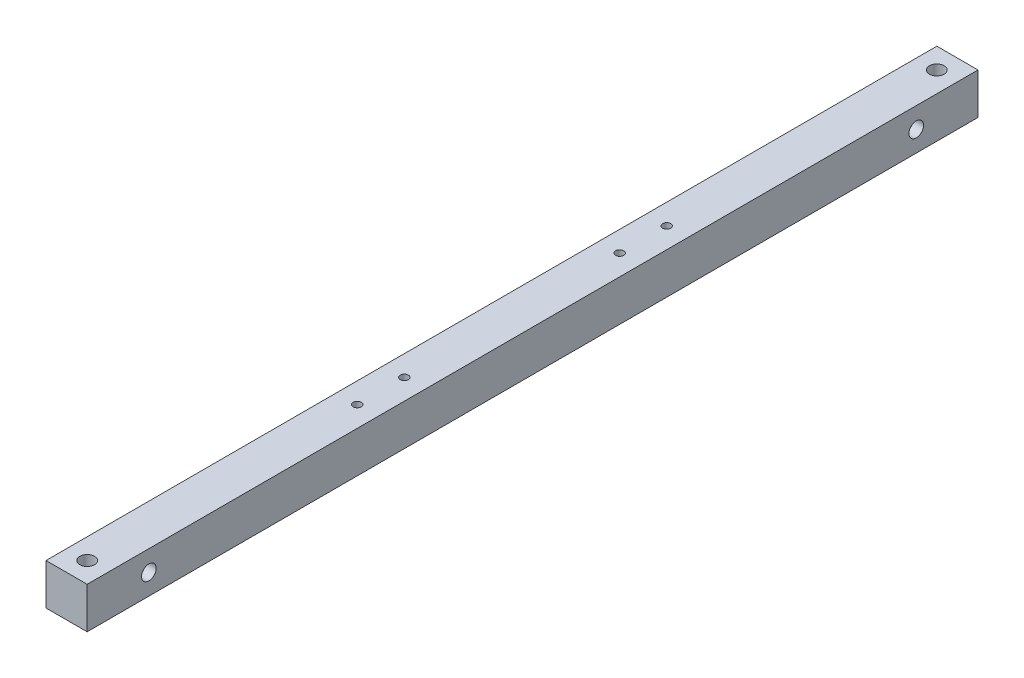
ISO-10303-21;
HEADER;
FILE_DESCRIPTION(('STEP AP214'),'2;1');
FILE_NAME('part.step','',(''),(''),'','','');
FILE_SCHEMA(('AUTOMOTIVE_DESIGN { 1 0 10303 214 1 1 1 1 }'));
ENDSEC;
DATA;
#1=APPLICATION_CONTEXT('core data for automotive mechanical design processes');
#2=APPLICATION_PROTOCOL_DEFINITION('international standard','automotive_design',2000,#1);
#3=PRODUCT_CONTEXT('',#1,'mechanical');
#4=PRODUCT('Part','Part','',(#3));
#5=PRODUCT_RELATED_PRODUCT_CATEGORY('part','',(#4));
#6=PRODUCT_DEFINITION_FORMATION('','',#4);
#7=PRODUCT_DEFINITION_CONTEXT('part definition',#1,'design');
#8=PRODUCT_DEFINITION('design','',#6,#7);
#9=PRODUCT_DEFINITION_SHAPE('','',#8);
#10=(LENGTH_UNIT() NAMED_UNIT(*) SI_UNIT(.MILLI.,.METRE.));
#11=(NAMED_UNIT(*) PLANE_ANGLE_UNIT() SI_UNIT($,.RADIAN.));
#12=(NAMED_UNIT(*) SI_UNIT($,.STERADIAN.) SOLID_ANGLE_UNIT());
#13=UNCERTAINTY_MEASURE_WITH_UNIT(LENGTH_MEASURE(1.E-05),#10,'distance_accuracy_value','');
#14=(GEOMETRIC_REPRESENTATION_CONTEXT(3) GLOBAL_UNCERTAINTY_ASSIGNED_CONTEXT((#13)) GLOBAL_UNIT_ASSIGNED_CONTEXT((#10,
#11,#12)) REPRESENTATION_CONTEXT('',''));
#15=CARTESIAN_POINT('',(0.,0.,0.));
#16=DIRECTION('',(0.,0.,1.));
#17=DIRECTION('',(1.,0.,0.));
#18=AXIS2_PLACEMENT_3D('',#15,#16,#17);
#19=CARTESIAN_POINT('',(0.,14.001,592.));
#20=DIRECTION('',(0.,-1.,0.));
#21=DIRECTION('',(0.,0.,-1.));
#22=AXIS2_PLACEMENT_3D('',#19,#20,#21);
#23=CYLINDRICAL_SURFACE('',#22,3.);
#24=CARTESIAN_POINT('',(0.,-14.,592.));
#25=DIRECTION('',(0.,-1.,0.));
#26=DIRECTION('',(0.,0.,-1.));
#27=AXIS2_PLACEMENT_3D('',#24,#25,#26);
#28=CIRCLE('',#27,3.);
#29=CARTESIAN_POINT('',(0.,-14.,589.));
#30=VERTEX_POINT('',#29);
#31=EDGE_CURVE('E122',#30,#30,#28,.T.);
#32=ORIENTED_EDGE('',*,*,#31,.T.);
#33=EDGE_LOOP('',(#32));
#34=FACE_BOUND('',#33,.T.);
#35=CARTESIAN_POINT('',(0.,7.,592.));
#36=DIRECTION('',(0.,1.,0.));
#37=DIRECTION('',(0.,0.,1.));
#38=AXIS2_PLACEMENT_3D('',#35,#36,#37);
#39=CIRCLE('',#38,3.);
#40=CARTESIAN_POINT('',(0.,7.,595.));
#41=VERTEX_POINT('',#40);
#42=EDGE_CURVE('E37',#41,#41,#39,.F.);
#43=ORIENTED_EDGE('',*,*,#42,.F.);
#44=EDGE_LOOP('',(#43));
#45=FACE_BOUND('',#44,.T.);
#46=ADVANCED_FACE('F33',(#34,#45),#23,.F.);
#47=CARTESIAN_POINT('',(0.,14.001,14.));
#48=DIRECTION('',(0.,-1.,0.));
#49=DIRECTION('',(0.,0.,-1.));
#50=AXIS2_PLACEMENT_3D('',#47,#48,#49);
#51=CYLINDRICAL_SURFACE('',#50,3.);
#52=CARTESIAN_POINT('',(0.,-14.,14.));
#53=DIRECTION('',(0.,-1.,0.));
#54=DIRECTION('',(0.,0.,-1.));
#55=AXIS2_PLACEMENT_3D('',#52,#53,#54);
#56=CIRCLE('',#55,3.);
#57=CARTESIAN_POINT('',(0.,-14.,11.));
#58=VERTEX_POINT('',#57);
#59=EDGE_CURVE('E141',#58,#58,#56,.T.);
#60=ORIENTED_EDGE('',*,*,#59,.T.);
#61=EDGE_LOOP('',(#60));
#62=FACE_BOUND('',#61,.T.);
#63=CARTESIAN_POINT('',(0.,7.,14.));
#64=DIRECTION('',(0.,1.,0.));
#65=DIRECTION('',(0.,0.,1.));
#66=AXIS2_PLACEMENT_3D('',#63,#64,#65);
#67=CIRCLE('',#66,3.);
#68=CARTESIAN_POINT('',(0.,7.,17.));
#69=VERTEX_POINT('',#68);
#70=EDGE_CURVE('E116',#69,#69,#67,.F.);
#71=ORIENTED_EDGE('',*,*,#70,.F.);
#72=EDGE_LOOP('',(#71));
#73=FACE_BOUND('',#72,.T.);
#74=ADVANCED_FACE('F166',(#62,#73),#51,.F.);
#75=CARTESIAN_POINT('',(14.,-14.,606.));
#76=DIRECTION('',(-1.,0.,0.));
#77=DIRECTION('',(0.,0.,1.));
#78=AXIS2_PLACEMENT_3D('',#75,#76,#77);
#79=PLANE('',#78);
#80=CARTESIAN_POINT('',(14.,0.,564.));
#81=DIRECTION('',(1.,0.,0.));
#82=DIRECTION('',(0.,0.,-1.));
#83=AXIS2_PLACEMENT_3D('',#80,#81,#82);
#84=CIRCLE('',#83,5.00000000000004);
#85=CARTESIAN_POINT('',(14.,0.,559.));
#86=VERTEX_POINT('',#85);
#87=EDGE_CURVE('E153',#86,#86,#84,.T.);
#88=ORIENTED_EDGE('',*,*,#87,.F.);
#89=EDGE_LOOP('',(#88));
#90=FACE_BOUND('',#89,.T.);
#91=CARTESIAN_POINT('',(14.,0.,42.));
#92=DIRECTION('',(1.,0.,0.));
#93=DIRECTION('',(0.,0.,-1.));
#94=AXIS2_PLACEMENT_3D('',#91,#92,#93);
#95=CIRCLE('',#94,5.);
#96=CARTESIAN_POINT('',(14.,0.,37.));
#97=VERTEX_POINT('',#96);
#98=EDGE_CURVE('E115',#97,#97,#95,.T.);
#99=ORIENTED_EDGE('',*,*,#98,.F.);
#100=EDGE_LOOP('',(#99));
#101=FACE_BOUND('',#100,.T.);
#102=DIRECTION('',(0.,1.,0.));
#103=VECTOR('',#102,1.);
#104=CARTESIAN_POINT('',(14.,-14.,0.));
#105=LINE('',#104,#103);
#106=CARTESIAN_POINT('',(14.,-14.,0.));
#107=VERTEX_POINT('',#106);
#108=CARTESIAN_POINT('',(14.,14.,0.));
#109=VERTEX_POINT('',#108);
#110=EDGE_CURVE('E100',#107,#109,#105,.T.);
#111=ORIENTED_EDGE('',*,*,#110,.T.);
#112=DIRECTION('',(0.,0.,-1.));
#113=VECTOR('',#112,1.);
#114=CARTESIAN_POINT('',(14.,14.,606.));
#115=LINE('',#114,#113);
#116=CARTESIAN_POINT('',(14.,14.,606.));
#117=VERTEX_POINT('',#116);
#118=EDGE_CURVE('E11',#117,#109,#115,.T.);
#119=ORIENTED_EDGE('',*,*,#118,.F.);
#120=DIRECTION('',(0.,1.,0.));
#121=VECTOR('',#120,1.);
#122=CARTESIAN_POINT('',(14.,-14.,606.));
#123=LINE('',#122,#121);
#124=CARTESIAN_POINT('',(14.,-14.,606.));
#125=VERTEX_POINT('',#124);
#126=EDGE_CURVE('E87',#125,#117,#123,.T.);
#127=ORIENTED_EDGE('',*,*,#126,.F.);
#128=DIRECTION('',(0.,0.,-1.));
#129=VECTOR('',#128,1.);
#130=CARTESIAN_POINT('',(14.,-14.,606.));
#131=LINE('',#130,#129);
#132=EDGE_CURVE('E96',#125,#107,#131,.T.);
#133=ORIENTED_EDGE('',*,*,#132,.T.);
#134=EDGE_LOOP('',(#111,#119,#127,#133));
#135=FACE_BOUND('',#134,.T.);
#136=ADVANCED_FACE('F35',(#90,#101,#135),#79,.F.);
#137=CARTESIAN_POINT('',(-14.,14.,606.));
#138=DIRECTION('',(0.,-1.,0.));
#139=DIRECTION('',(0.,0.,-1.));
#140=AXIS2_PLACEMENT_3D('',#137,#138,#139);
#141=PLANE('',#140);
#142=CARTESIAN_POINT('',(0.,14.,408.25));
#143=DIRECTION('',(0.,1.,0.));
#144=DIRECTION('',(0.,0.,1.));
#145=AXIS2_PLACEMENT_3D('',#142,#143,#144);
#146=CIRCLE('',#145,2.75);
#147=CARTESIAN_POINT('',(0.,14.,411.));
#148=VERTEX_POINT('',#147);
#149=EDGE_CURVE('E239',#148,#148,#146,.T.);
#150=ORIENTED_EDGE('',*,*,#149,.F.);
#151=EDGE_LOOP('',(#150));
#152=FACE_BOUND('',#151,.T.);
#153=CARTESIAN_POINT('',(0.,14.,376.25));
#154=DIRECTION('',(0.,1.,0.));
#155=DIRECTION('',(0.,0.,1.));
#156=AXIS2_PLACEMENT_3D('',#153,#154,#155);
#157=CIRCLE('',#156,2.75);
#158=CARTESIAN_POINT('',(0.,14.,379.));
#159=VERTEX_POINT('',#158);
#160=EDGE_CURVE('E243',#159,#159,#157,.T.);
#161=ORIENTED_EDGE('',*,*,#160,.F.);
#162=EDGE_LOOP('',(#161));
#163=FACE_BOUND('',#162,.T.);
#164=CARTESIAN_POINT('',(0.,14.,229.75));
#165=DIRECTION('',(0.,1.,0.));
#166=DIRECTION('',(0.,0.,-1.));
#167=AXIS2_PLACEMENT_3D('',#164,#165,#166);
#168=CIRCLE('',#167,2.75);
#169=CARTESIAN_POINT('',(0.,14.,227.));
#170=VERTEX_POINT('',#169);
#171=EDGE_CURVE('E247',#170,#170,#168,.T.);
#172=ORIENTED_EDGE('',*,*,#171,.F.);
#173=EDGE_LOOP('',(#172));
#174=FACE_BOUND('',#173,.T.);
#175=CARTESIAN_POINT('',(0.,14.,197.75));
#176=DIRECTION('',(0.,1.,0.));
#177=DIRECTION('',(0.,0.,-1.));
#178=AXIS2_PLACEMENT_3D('',#175,#176,#177);
#179=CIRCLE('',#178,2.75);
#180=CARTESIAN_POINT('',(0.,14.,195.));
#181=VERTEX_POINT('',#180);
#182=EDGE_CURVE('E132',#181,#181,#179,.T.);
#183=ORIENTED_EDGE('',*,*,#182,.F.);
#184=EDGE_LOOP('',(#183));
#185=FACE_BOUND('',#184,.T.);
#186=CARTESIAN_POINT('',(0.,14.,592.));
#187=DIRECTION('',(0.,1.,0.));
#188=DIRECTION('',(0.,0.,1.));
#189=AXIS2_PLACEMENT_3D('',#186,#187,#188);
#190=CIRCLE('',#189,5.);
#191=CARTESIAN_POINT('',(0.,14.,597.));
#192=VERTEX_POINT('',#191);
#193=EDGE_CURVE('E124',#192,#192,#190,.T.);
#194=ORIENTED_EDGE('',*,*,#193,.F.);
#195=EDGE_LOOP('',(#194));
#196=FACE_BOUND('',#195,.T.);
#197=CARTESIAN_POINT('',(0.,14.,14.));
#198=DIRECTION('',(0.,1.,0.));
#199=DIRECTION('',(0.,0.,1.));
#200=AXIS2_PLACEMENT_3D('',#197,#198,#199);
#201=CIRCLE('',#200,5.);
#202=CARTESIAN_POINT('',(0.,14.,19.));
#203=VERTEX_POINT('',#202);
#204=EDGE_CURVE('E137',#203,#203,#201,.T.);
#205=ORIENTED_EDGE('',*,*,#204,.F.);
#206=EDGE_LOOP('',(#205));
#207=FACE_BOUND('',#206,.T.);
#208=DIRECTION('',(-1.,0.,0.));
#209=VECTOR('',#208,1.);
#210=CARTESIAN_POINT('',(-14.,14.,0.));
#211=LINE('',#210,#209);
#212=CARTESIAN_POINT('',(-14.,14.,0.));
#213=VERTEX_POINT('',#212);
#214=EDGE_CURVE('E91',#109,#213,#211,.T.);
#215=ORIENTED_EDGE('',*,*,#214,.T.);
#216=DIRECTION('',(0.,0.,-1.));
#217=VECTOR('',#216,1.);
#218=CARTESIAN_POINT('',(-14.,14.,606.));
#219=LINE('',#218,#217);
#220=CARTESIAN_POINT('',(-14.,14.,606.));
#221=VERTEX_POINT('',#220);
#222=EDGE_CURVE('E43',#221,#213,#219,.T.);
#223=ORIENTED_EDGE('',*,*,#222,.F.);
#224=DIRECTION('',(-1.,0.,0.));
#225=VECTOR('',#224,1.);
#226=CARTESIAN_POINT('',(-14.,14.,606.));
#227=LINE('',#226,#225);
#228=EDGE_CURVE('E82',#117,#221,#227,.T.);
#229=ORIENTED_EDGE('',*,*,#228,.F.);
#230=ORIENTED_EDGE('',*,*,#118,.T.);
#231=EDGE_LOOP('',(#215,#223,#229,#230));
#232=FACE_BOUND('',#231,.T.);
#233=ADVANCED_FACE('F90',(#152,#163,#174,#185,#196,#207,#232),#141,.F.);
#234=CARTESIAN_POINT('',(-14.,-14.,606.));
#235=DIRECTION('',(1.,0.,0.));
#236=DIRECTION('',(0.,0.,-1.));
#237=AXIS2_PLACEMENT_3D('',#234,#235,#236);
#238=PLANE('',#237);
#239=CARTESIAN_POINT('',(-14.,0.,564.));
#240=DIRECTION('',(1.,0.,0.));
#241=DIRECTION('',(0.,0.,-1.));
#242=AXIS2_PLACEMENT_3D('',#239,#240,#241);
#243=CIRCLE('',#242,3.00000000000005);
#244=CARTESIAN_POINT('',(-14.,0.,561.));
#245=VERTEX_POINT('',#244);
#246=EDGE_CURVE('E113',#245,#245,#243,.T.);
#247=ORIENTED_EDGE('',*,*,#246,.T.);
#248=EDGE_LOOP('',(#247));
#249=FACE_BOUND('',#248,.T.);
#250=CARTESIAN_POINT('',(-14.,0.,42.));
#251=DIRECTION('',(1.,0.,0.));
#252=DIRECTION('',(0.,0.,-1.));
#253=AXIS2_PLACEMENT_3D('',#250,#251,#252);
#254=CIRCLE('',#253,3.);
#255=CARTESIAN_POINT('',(-14.,0.,39.));
#256=VERTEX_POINT('',#255);
#257=EDGE_CURVE('E144',#256,#256,#254,.T.);
#258=ORIENTED_EDGE('',*,*,#257,.T.);
#259=EDGE_LOOP('',(#258));
#260=FACE_BOUND('',#259,.T.);
#261=DIRECTION('',(0.,-1.,0.));
#262=VECTOR('',#261,1.);
#263=CARTESIAN_POINT('',(-14.,-14.,0.));
#264=LINE('',#263,#262);
#265=CARTESIAN_POINT('',(-14.,-14.,0.));
#266=VERTEX_POINT('',#265);
#267=EDGE_CURVE('E69',#213,#266,#264,.T.);
#268=ORIENTED_EDGE('',*,*,#267,.T.);
#269=DIRECTION('',(0.,0.,-1.));
#270=VECTOR('',#269,1.);
#271=CARTESIAN_POINT('',(-14.,-14.,606.));
#272=LINE('',#271,#270);
#273=CARTESIAN_POINT('',(-14.,-14.,606.));
#274=VERTEX_POINT('',#273);
#275=EDGE_CURVE('E92',#274,#266,#272,.T.);
#276=ORIENTED_EDGE('',*,*,#275,.F.);
#277=DIRECTION('',(0.,-1.,0.));
#278=VECTOR('',#277,1.);
#279=CARTESIAN_POINT('',(-14.,-14.,606.));
#280=LINE('',#279,#278);
#281=EDGE_CURVE('E85',#221,#274,#280,.T.);
#282=ORIENTED_EDGE('',*,*,#281,.F.);
#283=ORIENTED_EDGE('',*,*,#222,.T.);
#284=EDGE_LOOP('',(#268,#276,#282,#283));
#285=FACE_BOUND('',#284,.T.);
#286=ADVANCED_FACE('F94',(#249,#260,#285),#238,.F.);
#287=CARTESIAN_POINT('',(-14.,-14.,606.));
#288=DIRECTION('',(0.,1.,0.));
#289=DIRECTION('',(0.,0.,1.));
#290=AXIS2_PLACEMENT_3D('',#287,#288,#289);
#291=PLANE('',#290);
#292=CARTESIAN_POINT('',(0.,-14.,408.25));
#293=DIRECTION('',(0.,1.,0.));
#294=DIRECTION('',(0.,0.,1.));
#295=AXIS2_PLACEMENT_3D('',#292,#293,#294);
#296=CIRCLE('',#295,2.75);
#297=CARTESIAN_POINT('',(0.,-14.,411.));
#298=VERTEX_POINT('',#297);
#299=EDGE_CURVE('E140',#298,#298,#296,.T.);
#300=ORIENTED_EDGE('',*,*,#299,.T.);
#301=EDGE_LOOP('',(#300));
#302=FACE_BOUND('',#301,.T.);
#303=CARTESIAN_POINT('',(0.,-14.,376.25));
#304=DIRECTION('',(0.,1.,0.));
#305=DIRECTION('',(0.,0.,1.));
#306=AXIS2_PLACEMENT_3D('',#303,#304,#305);
#307=CIRCLE('',#306,2.75);
#308=CARTESIAN_POINT('',(0.,-14.,379.));
#309=VERTEX_POINT('',#308);
#310=EDGE_CURVE('E292',#309,#309,#307,.T.);
#311=ORIENTED_EDGE('',*,*,#310,.T.);
#312=EDGE_LOOP('',(#311));
#313=FACE_BOUND('',#312,.T.);
#314=CARTESIAN_POINT('',(0.,-14.,229.75));
#315=DIRECTION('',(0.,1.,0.));
#316=DIRECTION('',(0.,0.,-1.));
#317=AXIS2_PLACEMENT_3D('',#314,#315,#316);
#318=CIRCLE('',#317,2.75);
#319=CARTESIAN_POINT('',(0.,-14.,227.));
#320=VERTEX_POINT('',#319);
#321=EDGE_CURVE('E299',#320,#320,#318,.T.);
#322=ORIENTED_EDGE('',*,*,#321,.T.);
#323=EDGE_LOOP('',(#322));
#324=FACE_BOUND('',#323,.T.);
#325=CARTESIAN_POINT('',(0.,-14.,197.75));
#326=DIRECTION('',(0.,1.,0.));
#327=DIRECTION('',(0.,0.,-1.));
#328=AXIS2_PLACEMENT_3D('',#325,#326,#327);
#329=CIRCLE('',#328,2.75);
#330=CARTESIAN_POINT('',(0.,-14.,195.));
#331=VERTEX_POINT('',#330);
#332=EDGE_CURVE('E302',#331,#331,#329,.T.);
#333=ORIENTED_EDGE('',*,*,#332,.T.);
#334=EDGE_LOOP('',(#333));
#335=FACE_BOUND('',#334,.T.);
#336=ORIENTED_EDGE('',*,*,#59,.F.);
#337=EDGE_LOOP('',(#336));
#338=FACE_BOUND('',#337,.T.);
#339=ORIENTED_EDGE('',*,*,#31,.F.);
#340=EDGE_LOOP('',(#339));
#341=FACE_BOUND('',#340,.T.);
#342=DIRECTION('',(1.,0.,0.));
#343=VECTOR('',#342,1.);
#344=CARTESIAN_POINT('',(-14.,-14.,0.));
#345=LINE('',#344,#343);
#346=EDGE_CURVE('E75',#266,#107,#345,.T.);
#347=ORIENTED_EDGE('',*,*,#346,.T.);
#348=ORIENTED_EDGE('',*,*,#132,.F.);
#349=DIRECTION('',(1.,0.,0.));
#350=VECTOR('',#349,1.);
#351=CARTESIAN_POINT('',(-14.,-14.,606.));
#352=LINE('',#351,#350);
#353=EDGE_CURVE('E52',#274,#125,#352,.T.);
#354=ORIENTED_EDGE('',*,*,#353,.F.);
#355=ORIENTED_EDGE('',*,*,#275,.T.);
#356=EDGE_LOOP('',(#347,#348,#354,#355));
#357=FACE_BOUND('',#356,.T.);
#358=ADVANCED_FACE('F180',(#302,#313,#324,#335,#338,#341,#357),#291,.F.);
#359=CARTESIAN_POINT('',(0.,0.,606.));
#360=DIRECTION('',(0.,0.,-1.));
#361=DIRECTION('',(-1.,0.,0.));
#362=AXIS2_PLACEMENT_3D('',#359,#360,#361);
#363=PLANE('',#362);
#364=ORIENTED_EDGE('',*,*,#126,.T.);
#365=ORIENTED_EDGE('',*,*,#228,.T.);
#366=ORIENTED_EDGE('',*,*,#281,.T.);
#367=ORIENTED_EDGE('',*,*,#353,.T.);
#368=EDGE_LOOP('',(#364,#365,#366,#367));
#369=FACE_BOUND('',#368,.T.);
#370=ADVANCED_FACE('F83',(#369),#363,.F.);
#371=CARTESIAN_POINT('',(0.,0.,0.));
#372=DIRECTION('',(0.,0.,-1.));
#373=DIRECTION('',(-1.,0.,0.));
#374=AXIS2_PLACEMENT_3D('',#371,#372,#373);
#375=PLANE('',#374);
#376=ORIENTED_EDGE('',*,*,#110,.F.);
#377=ORIENTED_EDGE('',*,*,#346,.F.);
#378=ORIENTED_EDGE('',*,*,#267,.F.);
#379=ORIENTED_EDGE('',*,*,#214,.F.);
#380=EDGE_LOOP('',(#376,#377,#378,#379));
#381=FACE_BOUND('',#380,.T.);
#382=ADVANCED_FACE('F170',(#381),#375,.T.);
#383=CARTESIAN_POINT('',(7.,0.,42.));
#384=DIRECTION('',(1.,0.,0.));
#385=DIRECTION('',(0.,0.,-1.));
#386=AXIS2_PLACEMENT_3D('',#383,#384,#385);
#387=CYLINDRICAL_SURFACE('',#386,5.);
#388=CARTESIAN_POINT('',(7.,0.,42.));
#389=DIRECTION('',(1.,0.,0.));
#390=DIRECTION('',(0.,0.,-1.));
#391=AXIS2_PLACEMENT_3D('',#388,#389,#390);
#392=CIRCLE('',#391,5.);
#393=CARTESIAN_POINT('',(7.,0.,37.));
#394=VERTEX_POINT('',#393);
#395=EDGE_CURVE('E156',#394,#394,#392,.T.);
#396=ORIENTED_EDGE('',*,*,#395,.F.);
#397=EDGE_LOOP('',(#396));
#398=FACE_BOUND('',#397,.T.);
#399=ORIENTED_EDGE('',*,*,#98,.T.);
#400=EDGE_LOOP('',(#399));
#401=FACE_BOUND('',#400,.T.);
#402=ADVANCED_FACE('F162',(#398,#401),#387,.F.);
#403=CARTESIAN_POINT('',(7.,0.,42.));
#404=DIRECTION('',(1.,0.,0.));
#405=DIRECTION('',(0.,0.,-1.));
#406=AXIS2_PLACEMENT_3D('',#403,#404,#405);
#407=PLANE('',#406);
#408=CARTESIAN_POINT('',(7.,0.,42.));
#409=DIRECTION('',(1.,0.,0.));
#410=DIRECTION('',(0.,0.,-1.));
#411=AXIS2_PLACEMENT_3D('',#408,#409,#410);
#412=CIRCLE('',#411,3.);
#413=CARTESIAN_POINT('',(7.,0.,39.));
#414=VERTEX_POINT('',#413);
#415=EDGE_CURVE('E112',#414,#414,#412,.T.);
#416=ORIENTED_EDGE('',*,*,#415,.F.);
#417=EDGE_LOOP('',(#416));
#418=FACE_BOUND('',#417,.T.);
#419=ORIENTED_EDGE('',*,*,#395,.T.);
#420=EDGE_LOOP('',(#419));
#421=FACE_BOUND('',#420,.T.);
#422=ADVANCED_FACE('F177',(#418,#421),#407,.T.);
#423=CARTESIAN_POINT('',(7.,0.,564.));
#424=DIRECTION('',(1.,0.,0.));
#425=DIRECTION('',(0.,0.,-1.));
#426=AXIS2_PLACEMENT_3D('',#423,#424,#425);
#427=CYLINDRICAL_SURFACE('',#426,5.00000000000004);
#428=CARTESIAN_POINT('',(7.,0.,564.));
#429=DIRECTION('',(1.,0.,0.));
#430=DIRECTION('',(0.,0.,-1.));
#431=AXIS2_PLACEMENT_3D('',#428,#429,#430);
#432=CIRCLE('',#431,5.00000000000004);
#433=CARTESIAN_POINT('',(7.,0.,559.));
#434=VERTEX_POINT('',#433);
#435=EDGE_CURVE('E103',#434,#434,#432,.T.);
#436=ORIENTED_EDGE('',*,*,#435,.F.);
#437=EDGE_LOOP('',(#436));
#438=FACE_BOUND('',#437,.T.);
#439=ORIENTED_EDGE('',*,*,#87,.T.);
#440=EDGE_LOOP('',(#439));
#441=FACE_BOUND('',#440,.T.);
#442=ADVANCED_FACE('F206',(#438,#441),#427,.F.);
#443=CARTESIAN_POINT('',(7.,0.,564.));
#444=DIRECTION('',(1.,0.,0.));
#445=DIRECTION('',(0.,0.,-1.));
#446=AXIS2_PLACEMENT_3D('',#443,#444,#445);
#447=PLANE('',#446);
#448=CARTESIAN_POINT('',(7.,0.,564.));
#449=DIRECTION('',(1.,0.,0.));
#450=DIRECTION('',(0.,0.,-1.));
#451=AXIS2_PLACEMENT_3D('',#448,#449,#450);
#452=CIRCLE('',#451,3.00000000000005);
#453=CARTESIAN_POINT('',(7.,0.,561.));
#454=VERTEX_POINT('',#453);
#455=EDGE_CURVE('E109',#454,#454,#452,.T.);
#456=ORIENTED_EDGE('',*,*,#455,.F.);
#457=EDGE_LOOP('',(#456));
#458=FACE_BOUND('',#457,.T.);
#459=ORIENTED_EDGE('',*,*,#435,.T.);
#460=EDGE_LOOP('',(#459));
#461=FACE_BOUND('',#460,.T.);
#462=ADVANCED_FACE('F199',(#458,#461),#447,.T.);
#463=CARTESIAN_POINT('',(-14.,0.,564.));
#464=DIRECTION('',(1.,0.,0.));
#465=DIRECTION('',(0.,0.,-1.));
#466=AXIS2_PLACEMENT_3D('',#463,#464,#465);
#467=CYLINDRICAL_SURFACE('',#466,3.00000000000005);
#468=ORIENTED_EDGE('',*,*,#455,.T.);
#469=EDGE_LOOP('',(#468));
#470=FACE_BOUND('',#469,.T.);
#471=ORIENTED_EDGE('',*,*,#246,.F.);
#472=EDGE_LOOP('',(#471));
#473=FACE_BOUND('',#472,.T.);
#474=ADVANCED_FACE('F195',(#470,#473),#467,.F.);
#475=CARTESIAN_POINT('',(-14.,0.,42.));
#476=DIRECTION('',(1.,0.,0.));
#477=DIRECTION('',(0.,0.,-1.));
#478=AXIS2_PLACEMENT_3D('',#475,#476,#477);
#479=CYLINDRICAL_SURFACE('',#478,3.);
#480=ORIENTED_EDGE('',*,*,#415,.T.);
#481=EDGE_LOOP('',(#480));
#482=FACE_BOUND('',#481,.T.);
#483=ORIENTED_EDGE('',*,*,#257,.F.);
#484=EDGE_LOOP('',(#483));
#485=FACE_BOUND('',#484,.T.);
#486=ADVANCED_FACE('F198',(#482,#485),#479,.F.);
#487=CARTESIAN_POINT('',(0.,7.,14.));
#488=DIRECTION('',(0.,1.,0.));
#489=DIRECTION('',(0.,0.,1.));
#490=AXIS2_PLACEMENT_3D('',#487,#488,#489);
#491=PLANE('',#490);
#492=CARTESIAN_POINT('',(0.,7.,14.));
#493=DIRECTION('',(0.,1.,0.));
#494=DIRECTION('',(0.,0.,1.));
#495=AXIS2_PLACEMENT_3D('',#492,#493,#494);
#496=CIRCLE('',#495,5.);
#497=CARTESIAN_POINT('',(0.,7.,19.));
#498=VERTEX_POINT('',#497);
#499=EDGE_CURVE('E129',#498,#498,#496,.T.);
#500=ORIENTED_EDGE('',*,*,#499,.T.);
#501=EDGE_LOOP('',(#500));
#502=FACE_BOUND('',#501,.T.);
#503=ORIENTED_EDGE('',*,*,#70,.T.);
#504=EDGE_LOOP('',(#503));
#505=FACE_BOUND('',#504,.T.);
#506=ADVANCED_FACE('F202',(#502,#505),#491,.T.);
#507=CARTESIAN_POINT('',(0.,7.,14.));
#508=DIRECTION('',(0.,1.,0.));
#509=DIRECTION('',(0.,0.,1.));
#510=AXIS2_PLACEMENT_3D('',#507,#508,#509);
#511=CYLINDRICAL_SURFACE('',#510,5.);
#512=ORIENTED_EDGE('',*,*,#499,.F.);
#513=EDGE_LOOP('',(#512));
#514=FACE_BOUND('',#513,.T.);
#515=ORIENTED_EDGE('',*,*,#204,.T.);
#516=EDGE_LOOP('',(#515));
#517=FACE_BOUND('',#516,.T.);
#518=ADVANCED_FACE('F255',(#514,#517),#511,.F.);
#519=CARTESIAN_POINT('',(0.,7.,592.));
#520=DIRECTION('',(0.,1.,0.));
#521=DIRECTION('',(0.,0.,1.));
#522=AXIS2_PLACEMENT_3D('',#519,#520,#521);
#523=PLANE('',#522);
#524=CARTESIAN_POINT('',(0.,7.,592.));
#525=DIRECTION('',(0.,1.,0.));
#526=DIRECTION('',(0.,0.,1.));
#527=AXIS2_PLACEMENT_3D('',#524,#525,#526);
#528=CIRCLE('',#527,5.);
#529=CARTESIAN_POINT('',(0.,7.,597.));
#530=VERTEX_POINT('',#529);
#531=EDGE_CURVE('E118',#530,#530,#528,.T.);
#532=ORIENTED_EDGE('',*,*,#531,.T.);
#533=EDGE_LOOP('',(#532));
#534=FACE_BOUND('',#533,.T.);
#535=ORIENTED_EDGE('',*,*,#42,.T.);
#536=EDGE_LOOP('',(#535));
#537=FACE_BOUND('',#536,.T.);
#538=ADVANCED_FACE('F257',(#534,#537),#523,.T.);
#539=CARTESIAN_POINT('',(0.,7.,592.));
#540=DIRECTION('',(0.,1.,0.));
#541=DIRECTION('',(0.,0.,1.));
#542=AXIS2_PLACEMENT_3D('',#539,#540,#541);
#543=CYLINDRICAL_SURFACE('',#542,5.);
#544=ORIENTED_EDGE('',*,*,#531,.F.);
#545=EDGE_LOOP('',(#544));
#546=FACE_BOUND('',#545,.T.);
#547=ORIENTED_EDGE('',*,*,#193,.T.);
#548=EDGE_LOOP('',(#547));
#549=FACE_BOUND('',#548,.T.);
#550=ADVANCED_FACE('F263',(#546,#549),#543,.F.);
#551=CARTESIAN_POINT('',(0.,-14.,197.75));
#552=DIRECTION('',(0.,1.,0.));
#553=DIRECTION('',(0.,0.,1.));
#554=AXIS2_PLACEMENT_3D('',#551,#552,#553);
#555=CYLINDRICAL_SURFACE('',#554,2.75);
#556=ORIENTED_EDGE('',*,*,#332,.F.);
#557=EDGE_LOOP('',(#556));
#558=FACE_BOUND('',#557,.T.);
#559=ORIENTED_EDGE('',*,*,#182,.T.);
#560=EDGE_LOOP('',(#559));
#561=FACE_BOUND('',#560,.T.);
#562=ADVANCED_FACE('F270',(#558,#561),#555,.F.);
#563=CARTESIAN_POINT('',(0.,-14.,229.75));
#564=DIRECTION('',(0.,1.,0.));
#565=DIRECTION('',(0.,0.,1.));
#566=AXIS2_PLACEMENT_3D('',#563,#564,#565);
#567=CYLINDRICAL_SURFACE('',#566,2.75);
#568=ORIENTED_EDGE('',*,*,#321,.F.);
#569=EDGE_LOOP('',(#568));
#570=FACE_BOUND('',#569,.T.);
#571=ORIENTED_EDGE('',*,*,#171,.T.);
#572=EDGE_LOOP('',(#571));
#573=FACE_BOUND('',#572,.T.);
#574=ADVANCED_FACE('F275',(#570,#573),#567,.F.);
#575=CARTESIAN_POINT('',(0.,-14.,376.25));
#576=DIRECTION('',(0.,1.,0.));
#577=DIRECTION('',(0.,0.,1.));
#578=AXIS2_PLACEMENT_3D('',#575,#576,#577);
#579=CYLINDRICAL_SURFACE('',#578,2.75);
#580=ORIENTED_EDGE('',*,*,#310,.F.);
#581=EDGE_LOOP('',(#580));
#582=FACE_BOUND('',#581,.T.);
#583=ORIENTED_EDGE('',*,*,#160,.T.);
#584=EDGE_LOOP('',(#583));
#585=FACE_BOUND('',#584,.T.);
#586=ADVANCED_FACE('F279',(#582,#585),#579,.F.);
#587=CARTESIAN_POINT('',(0.,-14.,408.25));
#588=DIRECTION('',(0.,1.,0.));
#589=DIRECTION('',(0.,0.,1.));
#590=AXIS2_PLACEMENT_3D('',#587,#588,#589);
#591=CYLINDRICAL_SURFACE('',#590,2.75);
#592=ORIENTED_EDGE('',*,*,#299,.F.);
#593=EDGE_LOOP('',(#592));
#594=FACE_BOUND('',#593,.T.);
#595=ORIENTED_EDGE('',*,*,#149,.T.);
#596=EDGE_LOOP('',(#595));
#597=FACE_BOUND('',#596,.T.);
#598=ADVANCED_FACE('F283',(#594,#597),#591,.F.);
#599=CLOSED_SHELL('',(#46,#74,#136,#233,#286,#358,#370,#382,#402,#422,#442,#462,#474,#486,#506,
#518,#538,#550,#562,#574,#586,#598));
#600=MANIFOLD_SOLID_BREP('B2',#599);
#601=ADVANCED_BREP_SHAPE_REPRESENTATION('',(#18,#600),#14);
#602=SHAPE_DEFINITION_REPRESENTATION(#9,#601);
ENDSEC;
END-ISO-10303-21;
